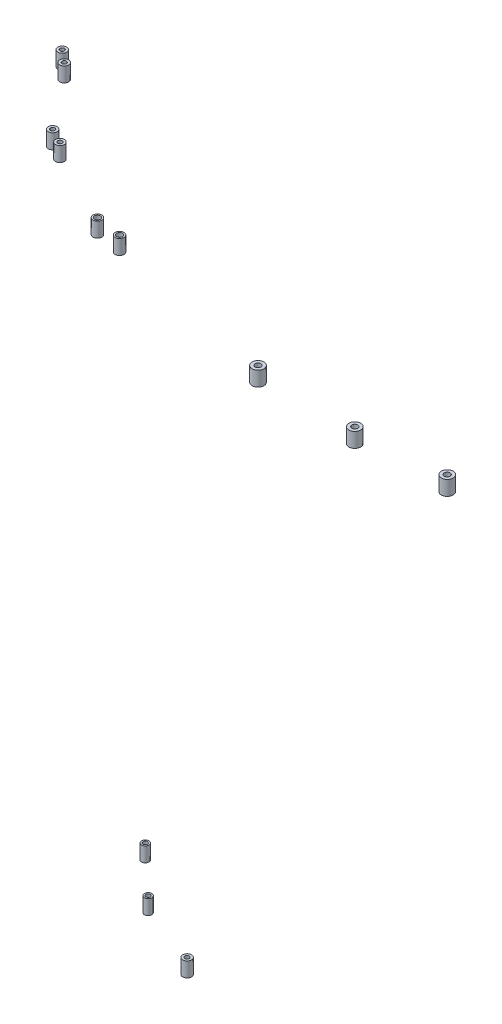
ISO-10303-21;
HEADER;
FILE_DESCRIPTION(('STEP AP214'),'2;1');
FILE_NAME('part.step','',(''),(''),'','','');
FILE_SCHEMA(('AUTOMOTIVE_DESIGN { 1 0 10303 214 1 1 1 1 }'));
ENDSEC;
DATA;
#1=APPLICATION_CONTEXT('core data for automotive mechanical design processes');
#2=APPLICATION_PROTOCOL_DEFINITION('international standard','automotive_design',2000,#1);
#3=PRODUCT_CONTEXT('',#1,'mechanical');
#4=PRODUCT('Part','Part','',(#3));
#5=PRODUCT_RELATED_PRODUCT_CATEGORY('part','',(#4));
#6=PRODUCT_DEFINITION_FORMATION('','',#4);
#7=PRODUCT_DEFINITION_CONTEXT('part definition',#1,'design');
#8=PRODUCT_DEFINITION('design','',#6,#7);
#9=PRODUCT_DEFINITION_SHAPE('','',#8);
#10=(LENGTH_UNIT() NAMED_UNIT(*) SI_UNIT(.MILLI.,.METRE.));
#11=(NAMED_UNIT(*) PLANE_ANGLE_UNIT() SI_UNIT($,.RADIAN.));
#12=(NAMED_UNIT(*) SI_UNIT($,.STERADIAN.) SOLID_ANGLE_UNIT());
#13=UNCERTAINTY_MEASURE_WITH_UNIT(LENGTH_MEASURE(1.E-05),#10,'distance_accuracy_value','');
#14=(GEOMETRIC_REPRESENTATION_CONTEXT(3) GLOBAL_UNCERTAINTY_ASSIGNED_CONTEXT((#13)) GLOBAL_UNIT_ASSIGNED_CONTEXT((#10,
#11,#12)) REPRESENTATION_CONTEXT('',''));
#15=CARTESIAN_POINT('',(0.,0.,0.));
#16=DIRECTION('',(0.,0.,1.));
#17=DIRECTION('',(1.,0.,0.));
#18=AXIS2_PLACEMENT_3D('',#15,#16,#17);
#19=CARTESIAN_POINT('',(-289.687055909534,300.199999999995,-282.424125212581));
#20=DIRECTION('',(0.,1.,1.00971538177767E-12));
#21=DIRECTION('',(0.,1.00971538177767E-12,-1.));
#22=AXIS2_PLACEMENT_3D('',#19,#20,#21);
#23=CYLINDRICAL_SURFACE('',#22,2.99999999999999);
#24=CARTESIAN_POINT('',(-289.687055909534,300.199999999995,-282.424125212581));
#25=DIRECTION('',(0.,-1.,-1.00971538177767E-12));
#26=DIRECTION('',(0.,1.00971538177767E-12,-1.));
#27=AXIS2_PLACEMENT_3D('',#24,#25,#26);
#28=CIRCLE('',#27,2.99999999999999);
#29=CARTESIAN_POINT('',(-289.687055909534,300.199999999998,-285.424125212581));
#30=VERTEX_POINT('',#29);
#31=EDGE_CURVE('E11',#30,#30,#28,.T.);
#32=ORIENTED_EDGE('',*,*,#31,.F.);
#33=EDGE_LOOP('',(#32));
#34=FACE_BOUND('',#33,.T.);
#35=CARTESIAN_POINT('',(-289.687055909534,310.199999999995,-282.424125212571));
#36=DIRECTION('',(0.,-1.,-1.00971538177767E-12));
#37=DIRECTION('',(0.,1.00971538177767E-12,-1.));
#38=AXIS2_PLACEMENT_3D('',#35,#36,#37);
#39=CIRCLE('',#38,2.99999999999999);
#40=CARTESIAN_POINT('',(-289.687055909534,310.199999999998,-285.424125212571));
#41=VERTEX_POINT('',#40);
#42=EDGE_CURVE('E47',#41,#41,#39,.T.);
#43=ORIENTED_EDGE('',*,*,#42,.T.);
#44=EDGE_LOOP('',(#43));
#45=FACE_BOUND('',#44,.T.);
#46=ADVANCED_FACE('F44',(#34,#45),#23,.T.);
#47=CARTESIAN_POINT('',(-289.687055909534,300.199999999995,-282.424125212581));
#48=DIRECTION('',(0.,1.,1.00971538177767E-12));
#49=DIRECTION('',(0.,1.00971538177767E-12,-1.));
#50=AXIS2_PLACEMENT_3D('',#47,#48,#49);
#51=PLANE('',#50);
#52=CARTESIAN_POINT('',(-289.687055909534,300.199999999995,-282.424125212581));
#53=DIRECTION('',(0.,-1.,-1.00971538177767E-12));
#54=DIRECTION('',(0.,1.00971538177767E-12,-1.));
#55=AXIS2_PLACEMENT_3D('',#52,#53,#54);
#56=CIRCLE('',#55,1.50000000000002);
#57=CARTESIAN_POINT('',(-289.687055909534,300.199999999997,-283.924125212581));
#58=VERTEX_POINT('',#57);
#59=EDGE_CURVE('E54',#58,#58,#56,.T.);
#60=ORIENTED_EDGE('',*,*,#59,.F.);
#61=EDGE_LOOP('',(#60));
#62=FACE_BOUND('',#61,.T.);
#63=ORIENTED_EDGE('',*,*,#31,.T.);
#64=EDGE_LOOP('',(#63));
#65=FACE_BOUND('',#64,.T.);
#66=ADVANCED_FACE('F65',(#62,#65),#51,.F.);
#67=CARTESIAN_POINT('',(-289.687055909534,310.199999999995,-282.424125212571));
#68=DIRECTION('',(0.,1.,1.00971538177767E-12));
#69=DIRECTION('',(0.,1.00971538177767E-12,-1.));
#70=AXIS2_PLACEMENT_3D('',#67,#68,#69);
#71=PLANE('',#70);
#72=CARTESIAN_POINT('',(-289.687055909534,310.199999999995,-282.424125212571));
#73=DIRECTION('',(0.,-1.,-1.00971538177767E-12));
#74=DIRECTION('',(0.,1.00971538177767E-12,-1.));
#75=AXIS2_PLACEMENT_3D('',#72,#73,#74);
#76=CIRCLE('',#75,1.50000000000002);
#77=CARTESIAN_POINT('',(-289.687055909534,310.199999999997,-283.924125212571));
#78=VERTEX_POINT('',#77);
#79=EDGE_CURVE('E56',#78,#78,#76,.T.);
#80=ORIENTED_EDGE('',*,*,#79,.T.);
#81=EDGE_LOOP('',(#80));
#82=FACE_BOUND('',#81,.T.);
#83=ORIENTED_EDGE('',*,*,#42,.F.);
#84=EDGE_LOOP('',(#83));
#85=FACE_BOUND('',#84,.T.);
#86=ADVANCED_FACE('F67',(#82,#85),#71,.T.);
#87=CARTESIAN_POINT('',(-289.687055909534,300.199999999995,-282.424125212581));
#88=DIRECTION('',(0.,1.,1.00971538177767E-12));
#89=DIRECTION('',(0.,1.00971538177767E-12,-1.));
#90=AXIS2_PLACEMENT_3D('',#87,#88,#89);
#91=CYLINDRICAL_SURFACE('',#90,1.50000000000002);
#92=ORIENTED_EDGE('',*,*,#59,.T.);
#93=EDGE_LOOP('',(#92));
#94=FACE_BOUND('',#93,.T.);
#95=ORIENTED_EDGE('',*,*,#79,.F.);
#96=EDGE_LOOP('',(#95));
#97=FACE_BOUND('',#96,.T.);
#98=ADVANCED_FACE('F62',(#94,#97),#91,.F.);
#99=CLOSED_SHELL('',(#46,#66,#86,#98));
#100=MANIFOLD_SOLID_BREP('B2',#99);
#101=CARTESIAN_POINT('',(-339.082998520851,300.200000000017,-305.429754445419));
#102=DIRECTION('',(0.,1.,1.00971538177767E-12));
#103=DIRECTION('',(0.,1.00971538177767E-12,-1.));
#104=AXIS2_PLACEMENT_3D('',#101,#102,#103);
#105=CYLINDRICAL_SURFACE('',#104,2.50000000000002);
#106=CARTESIAN_POINT('',(-339.082998520851,300.200000000017,-305.429754445419));
#107=DIRECTION('',(0.,-1.,-1.00971538177767E-12));
#108=DIRECTION('',(0.,1.00971538177767E-12,-1.));
#109=AXIS2_PLACEMENT_3D('',#106,#107,#108);
#110=CIRCLE('',#109,2.50000000000002);
#111=CARTESIAN_POINT('',(-339.082998520851,300.200000000019,-307.929754445419));
#112=VERTEX_POINT('',#111);
#113=EDGE_CURVE('E43',#112,#112,#110,.T.);
#114=ORIENTED_EDGE('',*,*,#113,.F.);
#115=EDGE_LOOP('',(#114));
#116=FACE_BOUND('',#115,.T.);
#117=CARTESIAN_POINT('',(-339.082998520851,310.200000000017,-305.429754445409));
#118=DIRECTION('',(0.,-1.,-1.00971538177767E-12));
#119=DIRECTION('',(0.,1.00971538177767E-12,-1.));
#120=AXIS2_PLACEMENT_3D('',#117,#118,#119);
#121=CIRCLE('',#120,2.50000000000002);
#122=CARTESIAN_POINT('',(-339.082998520851,310.200000000019,-307.929754445409));
#123=VERTEX_POINT('',#122);
#124=EDGE_CURVE('E117',#123,#123,#121,.T.);
#125=ORIENTED_EDGE('',*,*,#124,.T.);
#126=EDGE_LOOP('',(#125));
#127=FACE_BOUND('',#126,.T.);
#128=ADVANCED_FACE('F114',(#116,#127),#105,.T.);
#129=CARTESIAN_POINT('',(-339.082998520851,300.200000000017,-305.429754445419));
#130=DIRECTION('',(0.,1.,1.00971538177767E-12));
#131=DIRECTION('',(0.,1.00971538177767E-12,-1.));
#132=AXIS2_PLACEMENT_3D('',#129,#130,#131);
#133=PLANE('',#132);
#134=CARTESIAN_POINT('',(-339.082998520851,300.200000000017,-305.429754445419));
#135=DIRECTION('',(0.,-1.,-1.00971538177767E-12));
#136=DIRECTION('',(0.,1.00971538177767E-12,-1.));
#137=AXIS2_PLACEMENT_3D('',#134,#135,#136);
#138=CIRCLE('',#137,1.50000000000002);
#139=CARTESIAN_POINT('',(-339.082998520851,300.200000000018,-306.929754445419));
#140=VERTEX_POINT('',#139);
#141=EDGE_CURVE('E124',#140,#140,#138,.T.);
#142=ORIENTED_EDGE('',*,*,#141,.F.);
#143=EDGE_LOOP('',(#142));
#144=FACE_BOUND('',#143,.T.);
#145=ORIENTED_EDGE('',*,*,#113,.T.);
#146=EDGE_LOOP('',(#145));
#147=FACE_BOUND('',#146,.T.);
#148=ADVANCED_FACE('F135',(#144,#147),#133,.F.);
#149=CARTESIAN_POINT('',(-339.082998520851,310.200000000017,-305.429754445409));
#150=DIRECTION('',(0.,1.,1.00971538177767E-12));
#151=DIRECTION('',(0.,1.00971538177767E-12,-1.));
#152=AXIS2_PLACEMENT_3D('',#149,#150,#151);
#153=PLANE('',#152);
#154=CARTESIAN_POINT('',(-339.082998520851,310.200000000017,-305.429754445409));
#155=DIRECTION('',(0.,-1.,-1.00971538177767E-12));
#156=DIRECTION('',(0.,1.00971538177767E-12,-1.));
#157=AXIS2_PLACEMENT_3D('',#154,#155,#156);
#158=CIRCLE('',#157,1.50000000000002);
#159=CARTESIAN_POINT('',(-339.082998520851,310.200000000018,-306.929754445409));
#160=VERTEX_POINT('',#159);
#161=EDGE_CURVE('E126',#160,#160,#158,.T.);
#162=ORIENTED_EDGE('',*,*,#161,.T.);
#163=EDGE_LOOP('',(#162));
#164=FACE_BOUND('',#163,.T.);
#165=ORIENTED_EDGE('',*,*,#124,.F.);
#166=EDGE_LOOP('',(#165));
#167=FACE_BOUND('',#166,.T.);
#168=ADVANCED_FACE('F137',(#164,#167),#153,.T.);
#169=CARTESIAN_POINT('',(-339.082998520851,300.200000000017,-305.429754445419));
#170=DIRECTION('',(0.,1.,1.00971538177767E-12));
#171=DIRECTION('',(0.,1.00971538177767E-12,-1.));
#172=AXIS2_PLACEMENT_3D('',#169,#170,#171);
#173=CYLINDRICAL_SURFACE('',#172,1.50000000000002);
#174=ORIENTED_EDGE('',*,*,#141,.T.);
#175=EDGE_LOOP('',(#174));
#176=FACE_BOUND('',#175,.T.);
#177=ORIENTED_EDGE('',*,*,#161,.F.);
#178=EDGE_LOOP('',(#177));
#179=FACE_BOUND('',#178,.T.);
#180=ADVANCED_FACE('F132',(#176,#179),#173,.F.);
#181=CLOSED_SHELL('',(#128,#148,#168,#180));
#182=MANIFOLD_SOLID_BREP('B6',#181);
#183=CARTESIAN_POINT('',(-370.956911026411,300.200000000046,-335.367132453129));
#184=DIRECTION('',(0.,1.,1.00971538177767E-12));
#185=DIRECTION('',(0.,1.00971538177767E-12,-1.));
#186=AXIS2_PLACEMENT_3D('',#183,#184,#185);
#187=CYLINDRICAL_SURFACE('',#186,2.50000000000002);
#188=CARTESIAN_POINT('',(-370.956911026411,300.200000000046,-335.367132453129));
#189=DIRECTION('',(0.,-1.,-1.00971538177767E-12));
#190=DIRECTION('',(0.,1.00971538177767E-12,-1.));
#191=AXIS2_PLACEMENT_3D('',#188,#189,#190);
#192=CIRCLE('',#191,2.50000000000002);
#193=CARTESIAN_POINT('',(-370.956911026411,300.200000000049,-337.867132453129));
#194=VERTEX_POINT('',#193);
#195=EDGE_CURVE('E113',#194,#194,#192,.T.);
#196=ORIENTED_EDGE('',*,*,#195,.F.);
#197=EDGE_LOOP('',(#196));
#198=FACE_BOUND('',#197,.T.);
#199=CARTESIAN_POINT('',(-370.956911026411,310.200000000046,-335.367132453118));
#200=DIRECTION('',(0.,-1.,-1.00971538177767E-12));
#201=DIRECTION('',(0.,1.00971538177767E-12,-1.));
#202=AXIS2_PLACEMENT_3D('',#199,#200,#201);
#203=CIRCLE('',#202,2.50000000000002);
#204=CARTESIAN_POINT('',(-370.956911026411,310.200000000049,-337.867132453118));
#205=VERTEX_POINT('',#204);
#206=EDGE_CURVE('E187',#205,#205,#203,.T.);
#207=ORIENTED_EDGE('',*,*,#206,.T.);
#208=EDGE_LOOP('',(#207));
#209=FACE_BOUND('',#208,.T.);
#210=ADVANCED_FACE('F184',(#198,#209),#187,.T.);
#211=CARTESIAN_POINT('',(-370.956911026411,300.200000000046,-335.367132453129));
#212=DIRECTION('',(0.,1.,1.00971538177767E-12));
#213=DIRECTION('',(0.,1.00971538177767E-12,-1.));
#214=AXIS2_PLACEMENT_3D('',#211,#212,#213);
#215=PLANE('',#214);
#216=CARTESIAN_POINT('',(-370.956911026411,300.200000000046,-335.367132453129));
#217=DIRECTION('',(0.,-1.,-1.00971538177767E-12));
#218=DIRECTION('',(0.,1.00971538177767E-12,-1.));
#219=AXIS2_PLACEMENT_3D('',#216,#217,#218);
#220=CIRCLE('',#219,1.50000000000002);
#221=CARTESIAN_POINT('',(-370.956911026411,300.200000000048,-336.867132453129));
#222=VERTEX_POINT('',#221);
#223=EDGE_CURVE('E194',#222,#222,#220,.T.);
#224=ORIENTED_EDGE('',*,*,#223,.F.);
#225=EDGE_LOOP('',(#224));
#226=FACE_BOUND('',#225,.T.);
#227=ORIENTED_EDGE('',*,*,#195,.T.);
#228=EDGE_LOOP('',(#227));
#229=FACE_BOUND('',#228,.T.);
#230=ADVANCED_FACE('F205',(#226,#229),#215,.F.);
#231=CARTESIAN_POINT('',(-370.956911026411,310.200000000046,-335.367132453118));
#232=DIRECTION('',(0.,1.,1.00971538177767E-12));
#233=DIRECTION('',(0.,1.00971538177767E-12,-1.));
#234=AXIS2_PLACEMENT_3D('',#231,#232,#233);
#235=PLANE('',#234);
#236=CARTESIAN_POINT('',(-370.956911026411,310.200000000046,-335.367132453118));
#237=DIRECTION('',(0.,-1.,-1.00971538177767E-12));
#238=DIRECTION('',(0.,1.00971538177767E-12,-1.));
#239=AXIS2_PLACEMENT_3D('',#236,#237,#238);
#240=CIRCLE('',#239,1.50000000000002);
#241=CARTESIAN_POINT('',(-370.956911026411,310.200000000048,-336.867132453118));
#242=VERTEX_POINT('',#241);
#243=EDGE_CURVE('E196',#242,#242,#240,.T.);
#244=ORIENTED_EDGE('',*,*,#243,.T.);
#245=EDGE_LOOP('',(#244));
#246=FACE_BOUND('',#245,.T.);
#247=ORIENTED_EDGE('',*,*,#206,.F.);
#248=EDGE_LOOP('',(#247));
#249=FACE_BOUND('',#248,.T.);
#250=ADVANCED_FACE('F207',(#246,#249),#235,.T.);
#251=CARTESIAN_POINT('',(-370.956911026411,300.200000000046,-335.367132453129));
#252=DIRECTION('',(0.,1.,1.00971538177767E-12));
#253=DIRECTION('',(0.,1.00971538177767E-12,-1.));
#254=AXIS2_PLACEMENT_3D('',#251,#252,#253);
#255=CYLINDRICAL_SURFACE('',#254,1.50000000000002);
#256=ORIENTED_EDGE('',*,*,#223,.T.);
#257=EDGE_LOOP('',(#256));
#258=FACE_BOUND('',#257,.T.);
#259=ORIENTED_EDGE('',*,*,#243,.F.);
#260=EDGE_LOOP('',(#259));
#261=FACE_BOUND('',#260,.T.);
#262=ADVANCED_FACE('F202',(#258,#261),#255,.F.);
#263=CLOSED_SHELL('',(#210,#230,#250,#262));
#264=MANIFOLD_SOLID_BREP('B38',#263);
#265=CARTESIAN_POINT('',(-94.9095215443751,690.,-263.802212935845));
#266=DIRECTION('',(0.,1.,0.));
#267=DIRECTION('',(0.,0.,-1.));
#268=AXIS2_PLACEMENT_3D('',#265,#266,#267);
#269=CYLINDRICAL_SURFACE('',#268,4.00000000000001);
#270=CARTESIAN_POINT('',(-94.9095215443751,690.,-263.802212935845));
#271=DIRECTION('',(0.,-1.,0.));
#272=DIRECTION('',(0.,0.,-1.));
#273=AXIS2_PLACEMENT_3D('',#270,#271,#272);
#274=CIRCLE('',#273,4.00000000000001);
#275=CARTESIAN_POINT('',(-94.9095215443751,690.,-267.802212935845));
#276=VERTEX_POINT('',#275);
#277=EDGE_CURVE('E183',#276,#276,#274,.T.);
#278=ORIENTED_EDGE('',*,*,#277,.F.);
#279=EDGE_LOOP('',(#278));
#280=FACE_BOUND('',#279,.T.);
#281=CARTESIAN_POINT('',(-94.9095215443751,700.,-263.802212935845));
#282=DIRECTION('',(0.,-1.,0.));
#283=DIRECTION('',(0.,0.,-1.));
#284=AXIS2_PLACEMENT_3D('',#281,#282,#283);
#285=CIRCLE('',#284,4.00000000000001);
#286=CARTESIAN_POINT('',(-94.9095215443751,700.,-267.802212935845));
#287=VERTEX_POINT('',#286);
#288=EDGE_CURVE('E257',#287,#287,#285,.T.);
#289=ORIENTED_EDGE('',*,*,#288,.T.);
#290=EDGE_LOOP('',(#289));
#291=FACE_BOUND('',#290,.T.);
#292=ADVANCED_FACE('F254',(#280,#291),#269,.T.);
#293=CARTESIAN_POINT('',(-94.9095215443751,690.,-263.802212935845));
#294=DIRECTION('',(0.,1.,0.));
#295=DIRECTION('',(0.,0.,-1.));
#296=AXIS2_PLACEMENT_3D('',#293,#294,#295);
#297=PLANE('',#296);
#298=CARTESIAN_POINT('',(-94.9095215443751,690.,-263.802212935845));
#299=DIRECTION('',(0.,-1.,0.));
#300=DIRECTION('',(0.,0.,-1.));
#301=AXIS2_PLACEMENT_3D('',#298,#299,#300);
#302=CIRCLE('',#301,2.);
#303=CARTESIAN_POINT('',(-94.9095215443751,690.,-265.802212935845));
#304=VERTEX_POINT('',#303);
#305=EDGE_CURVE('E264',#304,#304,#302,.T.);
#306=ORIENTED_EDGE('',*,*,#305,.F.);
#307=EDGE_LOOP('',(#306));
#308=FACE_BOUND('',#307,.T.);
#309=ORIENTED_EDGE('',*,*,#277,.T.);
#310=EDGE_LOOP('',(#309));
#311=FACE_BOUND('',#310,.T.);
#312=ADVANCED_FACE('F275',(#308,#311),#297,.F.);
#313=CARTESIAN_POINT('',(-94.9095215443751,700.,-263.802212935845));
#314=DIRECTION('',(0.,1.,0.));
#315=DIRECTION('',(0.,0.,-1.));
#316=AXIS2_PLACEMENT_3D('',#313,#314,#315);
#317=PLANE('',#316);
#318=CARTESIAN_POINT('',(-94.9095215443751,700.,-263.802212935845));
#319=DIRECTION('',(0.,-1.,0.));
#320=DIRECTION('',(0.,0.,-1.));
#321=AXIS2_PLACEMENT_3D('',#318,#319,#320);
#322=CIRCLE('',#321,2.);
#323=CARTESIAN_POINT('',(-94.9095215443751,700.,-265.802212935845));
#324=VERTEX_POINT('',#323);
#325=EDGE_CURVE('E266',#324,#324,#322,.T.);
#326=ORIENTED_EDGE('',*,*,#325,.T.);
#327=EDGE_LOOP('',(#326));
#328=FACE_BOUND('',#327,.T.);
#329=ORIENTED_EDGE('',*,*,#288,.F.);
#330=EDGE_LOOP('',(#329));
#331=FACE_BOUND('',#330,.T.);
#332=ADVANCED_FACE('F277',(#328,#331),#317,.T.);
#333=CARTESIAN_POINT('',(-94.9095215443751,690.,-263.802212935845));
#334=DIRECTION('',(0.,1.,0.));
#335=DIRECTION('',(0.,0.,-1.));
#336=AXIS2_PLACEMENT_3D('',#333,#334,#335);
#337=CYLINDRICAL_SURFACE('',#336,2.);
#338=ORIENTED_EDGE('',*,*,#305,.T.);
#339=EDGE_LOOP('',(#338));
#340=FACE_BOUND('',#339,.T.);
#341=ORIENTED_EDGE('',*,*,#325,.F.);
#342=EDGE_LOOP('',(#341));
#343=FACE_BOUND('',#342,.T.);
#344=ADVANCED_FACE('F272',(#340,#343),#337,.F.);
#345=CLOSED_SHELL('',(#292,#312,#332,#344));
#346=MANIFOLD_SOLID_BREP('B108',#345);
#347=CARTESIAN_POINT('',(-154.344703344319,690.,-260.643821632466));
#348=DIRECTION('',(0.,1.,0.));
#349=DIRECTION('',(0.,0.,-1.));
#350=AXIS2_PLACEMENT_3D('',#347,#348,#349);
#351=CYLINDRICAL_SURFACE('',#350,3.99999999999999);
#352=CARTESIAN_POINT('',(-154.344703344319,690.,-260.643821632466));
#353=DIRECTION('',(0.,-1.,0.));
#354=DIRECTION('',(0.,0.,-1.));
#355=AXIS2_PLACEMENT_3D('',#352,#353,#354);
#356=CIRCLE('',#355,3.99999999999999);
#357=CARTESIAN_POINT('',(-154.344703344319,690.,-264.643821632466));
#358=VERTEX_POINT('',#357);
#359=EDGE_CURVE('E253',#358,#358,#356,.T.);
#360=ORIENTED_EDGE('',*,*,#359,.F.);
#361=EDGE_LOOP('',(#360));
#362=FACE_BOUND('',#361,.T.);
#363=CARTESIAN_POINT('',(-154.344703344319,700.,-260.643821632466));
#364=DIRECTION('',(0.,-1.,0.));
#365=DIRECTION('',(0.,0.,-1.));
#366=AXIS2_PLACEMENT_3D('',#363,#364,#365);
#367=CIRCLE('',#366,3.99999999999999);
#368=CARTESIAN_POINT('',(-154.344703344319,700.,-264.643821632466));
#369=VERTEX_POINT('',#368);
#370=EDGE_CURVE('E327',#369,#369,#367,.T.);
#371=ORIENTED_EDGE('',*,*,#370,.T.);
#372=EDGE_LOOP('',(#371));
#373=FACE_BOUND('',#372,.T.);
#374=ADVANCED_FACE('F324',(#362,#373),#351,.T.);
#375=CARTESIAN_POINT('',(-154.344703344319,690.,-260.643821632466));
#376=DIRECTION('',(0.,1.,0.));
#377=DIRECTION('',(0.,0.,-1.));
#378=AXIS2_PLACEMENT_3D('',#375,#376,#377);
#379=PLANE('',#378);
#380=CARTESIAN_POINT('',(-154.344703344319,690.,-260.643821632466));
#381=DIRECTION('',(0.,-1.,0.));
#382=DIRECTION('',(0.,0.,-1.));
#383=AXIS2_PLACEMENT_3D('',#380,#381,#382);
#384=CIRCLE('',#383,2.);
#385=CARTESIAN_POINT('',(-154.344703344319,690.,-262.643821632466));
#386=VERTEX_POINT('',#385);
#387=EDGE_CURVE('E334',#386,#386,#384,.T.);
#388=ORIENTED_EDGE('',*,*,#387,.F.);
#389=EDGE_LOOP('',(#388));
#390=FACE_BOUND('',#389,.T.);
#391=ORIENTED_EDGE('',*,*,#359,.T.);
#392=EDGE_LOOP('',(#391));
#393=FACE_BOUND('',#392,.T.);
#394=ADVANCED_FACE('F345',(#390,#393),#379,.F.);
#395=CARTESIAN_POINT('',(-154.344703344319,700.,-260.643821632466));
#396=DIRECTION('',(0.,1.,0.));
#397=DIRECTION('',(0.,0.,-1.));
#398=AXIS2_PLACEMENT_3D('',#395,#396,#397);
#399=PLANE('',#398);
#400=CARTESIAN_POINT('',(-154.344703344319,700.,-260.643821632466));
#401=DIRECTION('',(0.,-1.,0.));
#402=DIRECTION('',(0.,0.,-1.));
#403=AXIS2_PLACEMENT_3D('',#400,#401,#402);
#404=CIRCLE('',#403,2.);
#405=CARTESIAN_POINT('',(-154.344703344319,700.,-262.643821632466));
#406=VERTEX_POINT('',#405);
#407=EDGE_CURVE('E336',#406,#406,#404,.T.);
#408=ORIENTED_EDGE('',*,*,#407,.T.);
#409=EDGE_LOOP('',(#408));
#410=FACE_BOUND('',#409,.T.);
#411=ORIENTED_EDGE('',*,*,#370,.F.);
#412=EDGE_LOOP('',(#411));
#413=FACE_BOUND('',#412,.T.);
#414=ADVANCED_FACE('F347',(#410,#413),#399,.T.);
#415=CARTESIAN_POINT('',(-154.344703344319,690.,-260.643821632466));
#416=DIRECTION('',(0.,1.,0.));
#417=DIRECTION('',(0.,0.,-1.));
#418=AXIS2_PLACEMENT_3D('',#415,#416,#417);
#419=CYLINDRICAL_SURFACE('',#418,2.);
#420=ORIENTED_EDGE('',*,*,#387,.T.);
#421=EDGE_LOOP('',(#420));
#422=FACE_BOUND('',#421,.T.);
#423=ORIENTED_EDGE('',*,*,#407,.F.);
#424=EDGE_LOOP('',(#423));
#425=FACE_BOUND('',#424,.T.);
#426=ADVANCED_FACE('F342',(#422,#425),#419,.F.);
#427=CLOSED_SHELL('',(#374,#394,#414,#426));
#428=MANIFOLD_SOLID_BREP('B178',#427);
#429=CARTESIAN_POINT('',(-223.024834580686,690.,-263.802212935845));
#430=DIRECTION('',(0.,1.,0.));
#431=DIRECTION('',(0.,0.,-1.));
#432=AXIS2_PLACEMENT_3D('',#429,#430,#431);
#433=CYLINDRICAL_SURFACE('',#432,3.99999999999999);
#434=CARTESIAN_POINT('',(-223.024834580686,690.,-263.802212935845));
#435=DIRECTION('',(0.,-1.,0.));
#436=DIRECTION('',(0.,0.,-1.));
#437=AXIS2_PLACEMENT_3D('',#434,#435,#436);
#438=CIRCLE('',#437,3.99999999999999);
#439=CARTESIAN_POINT('',(-223.024834580686,690.,-267.802212935845));
#440=VERTEX_POINT('',#439);
#441=EDGE_CURVE('E323',#440,#440,#438,.T.);
#442=ORIENTED_EDGE('',*,*,#441,.F.);
#443=EDGE_LOOP('',(#442));
#444=FACE_BOUND('',#443,.T.);
#445=CARTESIAN_POINT('',(-223.024834580686,700.,-263.802212935845));
#446=DIRECTION('',(0.,-1.,0.));
#447=DIRECTION('',(0.,0.,-1.));
#448=AXIS2_PLACEMENT_3D('',#445,#446,#447);
#449=CIRCLE('',#448,3.99999999999999);
#450=CARTESIAN_POINT('',(-223.024834580686,700.,-267.802212935845));
#451=VERTEX_POINT('',#450);
#452=EDGE_CURVE('E397',#451,#451,#449,.T.);
#453=ORIENTED_EDGE('',*,*,#452,.T.);
#454=EDGE_LOOP('',(#453));
#455=FACE_BOUND('',#454,.T.);
#456=ADVANCED_FACE('F394',(#444,#455),#433,.T.);
#457=CARTESIAN_POINT('',(-223.024834580686,690.,-263.802212935845));
#458=DIRECTION('',(0.,1.,0.));
#459=DIRECTION('',(0.,0.,-1.));
#460=AXIS2_PLACEMENT_3D('',#457,#458,#459);
#461=PLANE('',#460);
#462=CARTESIAN_POINT('',(-223.024834580686,690.,-263.802212935845));
#463=DIRECTION('',(0.,-1.,0.));
#464=DIRECTION('',(0.,0.,-1.));
#465=AXIS2_PLACEMENT_3D('',#462,#463,#464);
#466=CIRCLE('',#465,2.);
#467=CARTESIAN_POINT('',(-223.024834580686,690.,-265.802212935845));
#468=VERTEX_POINT('',#467);
#469=EDGE_CURVE('E404',#468,#468,#466,.T.);
#470=ORIENTED_EDGE('',*,*,#469,.F.);
#471=EDGE_LOOP('',(#470));
#472=FACE_BOUND('',#471,.T.);
#473=ORIENTED_EDGE('',*,*,#441,.T.);
#474=EDGE_LOOP('',(#473));
#475=FACE_BOUND('',#474,.T.);
#476=ADVANCED_FACE('F415',(#472,#475),#461,.F.);
#477=CARTESIAN_POINT('',(-223.024834580686,700.,-263.802212935845));
#478=DIRECTION('',(0.,1.,0.));
#479=DIRECTION('',(0.,0.,-1.));
#480=AXIS2_PLACEMENT_3D('',#477,#478,#479);
#481=PLANE('',#480);
#482=CARTESIAN_POINT('',(-223.024834580686,700.,-263.802212935845));
#483=DIRECTION('',(0.,-1.,0.));
#484=DIRECTION('',(0.,0.,-1.));
#485=AXIS2_PLACEMENT_3D('',#482,#483,#484);
#486=CIRCLE('',#485,2.);
#487=CARTESIAN_POINT('',(-223.024834580686,700.,-265.802212935845));
#488=VERTEX_POINT('',#487);
#489=EDGE_CURVE('E406',#488,#488,#486,.T.);
#490=ORIENTED_EDGE('',*,*,#489,.T.);
#491=EDGE_LOOP('',(#490));
#492=FACE_BOUND('',#491,.T.);
#493=ORIENTED_EDGE('',*,*,#452,.F.);
#494=EDGE_LOOP('',(#493));
#495=FACE_BOUND('',#494,.T.);
#496=ADVANCED_FACE('F417',(#492,#495),#481,.T.);
#497=CARTESIAN_POINT('',(-223.024834580686,690.,-263.802212935845));
#498=DIRECTION('',(0.,1.,0.));
#499=DIRECTION('',(0.,0.,-1.));
#500=AXIS2_PLACEMENT_3D('',#497,#498,#499);
#501=CYLINDRICAL_SURFACE('',#500,2.);
#502=ORIENTED_EDGE('',*,*,#469,.T.);
#503=EDGE_LOOP('',(#502));
#504=FACE_BOUND('',#503,.T.);
#505=ORIENTED_EDGE('',*,*,#489,.F.);
#506=EDGE_LOOP('',(#505));
#507=FACE_BOUND('',#506,.T.);
#508=ADVANCED_FACE('F412',(#504,#507),#501,.F.);
#509=CLOSED_SHELL('',(#456,#476,#496,#508));
#510=MANIFOLD_SOLID_BREP('B248',#509);
#511=CARTESIAN_POINT('',(-346.389872513205,690.,-293.396246383283));
#512=DIRECTION('',(0.,1.,0.));
#513=DIRECTION('',(0.,0.,-1.));
#514=AXIS2_PLACEMENT_3D('',#511,#512,#513);
#515=CYLINDRICAL_SURFACE('',#514,2.99999999999999);
#516=CARTESIAN_POINT('',(-346.389872513205,690.,-293.396246383283));
#517=DIRECTION('',(0.,-1.,0.));
#518=DIRECTION('',(0.,0.,-1.));
#519=AXIS2_PLACEMENT_3D('',#516,#517,#518);
#520=CIRCLE('',#519,2.99999999999999);
#521=CARTESIAN_POINT('',(-346.389872513205,690.,-296.396246383283));
#522=VERTEX_POINT('',#521);
#523=EDGE_CURVE('E393',#522,#522,#520,.T.);
#524=ORIENTED_EDGE('',*,*,#523,.F.);
#525=EDGE_LOOP('',(#524));
#526=FACE_BOUND('',#525,.T.);
#527=CARTESIAN_POINT('',(-346.389872513205,700.,-293.396246383283));
#528=DIRECTION('',(0.,-1.,0.));
#529=DIRECTION('',(0.,0.,-1.));
#530=AXIS2_PLACEMENT_3D('',#527,#528,#529);
#531=CIRCLE('',#530,2.99999999999999);
#532=CARTESIAN_POINT('',(-346.389872513205,700.,-296.396246383283));
#533=VERTEX_POINT('',#532);
#534=EDGE_CURVE('E467',#533,#533,#531,.T.);
#535=ORIENTED_EDGE('',*,*,#534,.T.);
#536=EDGE_LOOP('',(#535));
#537=FACE_BOUND('',#536,.T.);
#538=ADVANCED_FACE('F464',(#526,#537),#515,.T.);
#539=CARTESIAN_POINT('',(-346.389872513205,690.,-293.396246383283));
#540=DIRECTION('',(0.,1.,0.));
#541=DIRECTION('',(0.,0.,-1.));
#542=AXIS2_PLACEMENT_3D('',#539,#540,#541);
#543=PLANE('',#542);
#544=CARTESIAN_POINT('',(-346.389872513205,690.,-293.396246383283));
#545=DIRECTION('',(0.,-1.,0.));
#546=DIRECTION('',(0.,0.,-1.));
#547=AXIS2_PLACEMENT_3D('',#544,#545,#546);
#548=CIRCLE('',#547,2.);
#549=CARTESIAN_POINT('',(-346.389872513205,690.,-295.396246383283));
#550=VERTEX_POINT('',#549);
#551=EDGE_CURVE('E474',#550,#550,#548,.T.);
#552=ORIENTED_EDGE('',*,*,#551,.F.);
#553=EDGE_LOOP('',(#552));
#554=FACE_BOUND('',#553,.T.);
#555=ORIENTED_EDGE('',*,*,#523,.T.);
#556=EDGE_LOOP('',(#555));
#557=FACE_BOUND('',#556,.T.);
#558=ADVANCED_FACE('F485',(#554,#557),#543,.F.);
#559=CARTESIAN_POINT('',(-346.389872513205,700.,-293.396246383283));
#560=DIRECTION('',(0.,1.,0.));
#561=DIRECTION('',(0.,0.,-1.));
#562=AXIS2_PLACEMENT_3D('',#559,#560,#561);
#563=PLANE('',#562);
#564=CARTESIAN_POINT('',(-346.389872513205,700.,-293.396246383283));
#565=DIRECTION('',(0.,-1.,0.));
#566=DIRECTION('',(0.,0.,-1.));
#567=AXIS2_PLACEMENT_3D('',#564,#565,#566);
#568=CIRCLE('',#567,2.);
#569=CARTESIAN_POINT('',(-346.389872513205,700.,-295.396246383283));
#570=VERTEX_POINT('',#569);
#571=EDGE_CURVE('E476',#570,#570,#568,.T.);
#572=ORIENTED_EDGE('',*,*,#571,.T.);
#573=EDGE_LOOP('',(#572));
#574=FACE_BOUND('',#573,.T.);
#575=ORIENTED_EDGE('',*,*,#534,.F.);
#576=EDGE_LOOP('',(#575));
#577=FACE_BOUND('',#576,.T.);
#578=ADVANCED_FACE('F487',(#574,#577),#563,.T.);
#579=CARTESIAN_POINT('',(-346.389872513205,690.,-293.396246383283));
#580=DIRECTION('',(0.,1.,0.));
#581=DIRECTION('',(0.,0.,-1.));
#582=AXIS2_PLACEMENT_3D('',#579,#580,#581);
#583=CYLINDRICAL_SURFACE('',#582,2.);
#584=ORIENTED_EDGE('',*,*,#551,.T.);
#585=EDGE_LOOP('',(#584));
#586=FACE_BOUND('',#585,.T.);
#587=ORIENTED_EDGE('',*,*,#571,.F.);
#588=EDGE_LOOP('',(#587));
#589=FACE_BOUND('',#588,.T.);
#590=ADVANCED_FACE('F482',(#586,#589),#583,.F.);
#591=CLOSED_SHELL('',(#538,#558,#578,#590));
#592=MANIFOLD_SOLID_BREP('B318',#591);
#593=CARTESIAN_POINT('',(-364.051137420954,690.,-296.101801858513));
#594=DIRECTION('',(0.,1.,0.));
#595=DIRECTION('',(0.,0.,-1.));
#596=AXIS2_PLACEMENT_3D('',#593,#594,#595);
#597=CYLINDRICAL_SURFACE('',#596,2.99999999999999);
#598=CARTESIAN_POINT('',(-364.051137420954,690.,-296.101801858513));
#599=DIRECTION('',(0.,-1.,0.));
#600=DIRECTION('',(0.,0.,-1.));
#601=AXIS2_PLACEMENT_3D('',#598,#599,#600);
#602=CIRCLE('',#601,2.99999999999999);
#603=CARTESIAN_POINT('',(-364.051137420954,690.,-299.101801858513));
#604=VERTEX_POINT('',#603);
#605=EDGE_CURVE('E463',#604,#604,#602,.T.);
#606=ORIENTED_EDGE('',*,*,#605,.F.);
#607=EDGE_LOOP('',(#606));
#608=FACE_BOUND('',#607,.T.);
#609=CARTESIAN_POINT('',(-364.051137420954,700.,-296.101801858513));
#610=DIRECTION('',(0.,-1.,0.));
#611=DIRECTION('',(0.,0.,-1.));
#612=AXIS2_PLACEMENT_3D('',#609,#610,#611);
#613=CIRCLE('',#612,2.99999999999999);
#614=CARTESIAN_POINT('',(-364.051137420954,700.,-299.101801858513));
#615=VERTEX_POINT('',#614);
#616=EDGE_CURVE('E537',#615,#615,#613,.T.);
#617=ORIENTED_EDGE('',*,*,#616,.T.);
#618=EDGE_LOOP('',(#617));
#619=FACE_BOUND('',#618,.T.);
#620=ADVANCED_FACE('F534',(#608,#619),#597,.T.);
#621=CARTESIAN_POINT('',(-364.051137420954,690.,-296.101801858513));
#622=DIRECTION('',(0.,1.,0.));
#623=DIRECTION('',(0.,0.,-1.));
#624=AXIS2_PLACEMENT_3D('',#621,#622,#623);
#625=PLANE('',#624);
#626=CARTESIAN_POINT('',(-364.051137420954,690.,-296.101801858513));
#627=DIRECTION('',(0.,-1.,0.));
#628=DIRECTION('',(0.,0.,-1.));
#629=AXIS2_PLACEMENT_3D('',#626,#627,#628);
#630=CIRCLE('',#629,2.);
#631=CARTESIAN_POINT('',(-364.051137420954,690.,-298.101801858513));
#632=VERTEX_POINT('',#631);
#633=EDGE_CURVE('E544',#632,#632,#630,.T.);
#634=ORIENTED_EDGE('',*,*,#633,.F.);
#635=EDGE_LOOP('',(#634));
#636=FACE_BOUND('',#635,.T.);
#637=ORIENTED_EDGE('',*,*,#605,.T.);
#638=EDGE_LOOP('',(#637));
#639=FACE_BOUND('',#638,.T.);
#640=ADVANCED_FACE('F555',(#636,#639),#625,.F.);
#641=CARTESIAN_POINT('',(-364.051137420954,700.,-296.101801858513));
#642=DIRECTION('',(0.,1.,0.));
#643=DIRECTION('',(0.,0.,-1.));
#644=AXIS2_PLACEMENT_3D('',#641,#642,#643);
#645=PLANE('',#644);
#646=CARTESIAN_POINT('',(-364.051137420954,700.,-296.101801858513));
#647=DIRECTION('',(0.,-1.,0.));
#648=DIRECTION('',(0.,0.,-1.));
#649=AXIS2_PLACEMENT_3D('',#646,#647,#648);
#650=CIRCLE('',#649,2.);
#651=CARTESIAN_POINT('',(-364.051137420954,700.,-298.101801858513));
#652=VERTEX_POINT('',#651);
#653=EDGE_CURVE('E546',#652,#652,#650,.T.);
#654=ORIENTED_EDGE('',*,*,#653,.T.);
#655=EDGE_LOOP('',(#654));
#656=FACE_BOUND('',#655,.T.);
#657=ORIENTED_EDGE('',*,*,#616,.F.);
#658=EDGE_LOOP('',(#657));
#659=FACE_BOUND('',#658,.T.);
#660=ADVANCED_FACE('F557',(#656,#659),#645,.T.);
#661=CARTESIAN_POINT('',(-364.051137420954,690.,-296.101801858513));
#662=DIRECTION('',(0.,1.,0.));
#663=DIRECTION('',(0.,0.,-1.));
#664=AXIS2_PLACEMENT_3D('',#661,#662,#663);
#665=CYLINDRICAL_SURFACE('',#664,2.);
#666=ORIENTED_EDGE('',*,*,#633,.T.);
#667=EDGE_LOOP('',(#666));
#668=FACE_BOUND('',#667,.T.);
#669=ORIENTED_EDGE('',*,*,#653,.F.);
#670=EDGE_LOOP('',(#669));
#671=FACE_BOUND('',#670,.T.);
#672=ADVANCED_FACE('F552',(#668,#671),#665,.F.);
#673=CLOSED_SHELL('',(#620,#640,#660,#672));
#674=MANIFOLD_SOLID_BREP('B388',#673);
#675=CARTESIAN_POINT('',(-421.090050281492,690.,-327.725114351705));
#676=DIRECTION('',(0.,1.,0.));
#677=DIRECTION('',(0.,0.,-1.));
#678=AXIS2_PLACEMENT_3D('',#675,#676,#677);
#679=CYLINDRICAL_SURFACE('',#678,2.99999999999999);
#680=CARTESIAN_POINT('',(-421.090050281492,690.,-327.725114351705));
#681=DIRECTION('',(0.,-1.,0.));
#682=DIRECTION('',(0.,0.,-1.));
#683=AXIS2_PLACEMENT_3D('',#680,#681,#682);
#684=CIRCLE('',#683,2.99999999999999);
#685=CARTESIAN_POINT('',(-421.090050281492,690.,-330.725114351705));
#686=VERTEX_POINT('',#685);
#687=EDGE_CURVE('E533',#686,#686,#684,.T.);
#688=ORIENTED_EDGE('',*,*,#687,.F.);
#689=EDGE_LOOP('',(#688));
#690=FACE_BOUND('',#689,.T.);
#691=CARTESIAN_POINT('',(-421.090050281492,700.,-327.725114351705));
#692=DIRECTION('',(0.,-1.,0.));
#693=DIRECTION('',(0.,0.,-1.));
#694=AXIS2_PLACEMENT_3D('',#691,#692,#693);
#695=CIRCLE('',#694,2.99999999999999);
#696=CARTESIAN_POINT('',(-421.090050281492,700.,-330.725114351705));
#697=VERTEX_POINT('',#696);
#698=EDGE_CURVE('E607',#697,#697,#695,.T.);
#699=ORIENTED_EDGE('',*,*,#698,.T.);
#700=EDGE_LOOP('',(#699));
#701=FACE_BOUND('',#700,.T.);
#702=ADVANCED_FACE('F604',(#690,#701),#679,.T.);
#703=CARTESIAN_POINT('',(-421.090050281492,690.,-327.725114351705));
#704=DIRECTION('',(0.,1.,0.));
#705=DIRECTION('',(0.,0.,-1.));
#706=AXIS2_PLACEMENT_3D('',#703,#704,#705);
#707=PLANE('',#706);
#708=CARTESIAN_POINT('',(-421.090050281492,690.,-327.725114351705));
#709=DIRECTION('',(0.,-1.,0.));
#710=DIRECTION('',(0.,0.,-1.));
#711=AXIS2_PLACEMENT_3D('',#708,#709,#710);
#712=CIRCLE('',#711,1.50000000000002);
#713=CARTESIAN_POINT('',(-421.090050281492,690.,-329.225114351705));
#714=VERTEX_POINT('',#713);
#715=EDGE_CURVE('E614',#714,#714,#712,.T.);
#716=ORIENTED_EDGE('',*,*,#715,.F.);
#717=EDGE_LOOP('',(#716));
#718=FACE_BOUND('',#717,.T.);
#719=ORIENTED_EDGE('',*,*,#687,.T.);
#720=EDGE_LOOP('',(#719));
#721=FACE_BOUND('',#720,.T.);
#722=ADVANCED_FACE('F625',(#718,#721),#707,.F.);
#723=CARTESIAN_POINT('',(-421.090050281492,700.,-327.725114351705));
#724=DIRECTION('',(0.,1.,0.));
#725=DIRECTION('',(0.,0.,-1.));
#726=AXIS2_PLACEMENT_3D('',#723,#724,#725);
#727=PLANE('',#726);
#728=CARTESIAN_POINT('',(-421.090050281492,700.,-327.725114351705));
#729=DIRECTION('',(0.,-1.,0.));
#730=DIRECTION('',(0.,0.,-1.));
#731=AXIS2_PLACEMENT_3D('',#728,#729,#730);
#732=CIRCLE('',#731,1.50000000000002);
#733=CARTESIAN_POINT('',(-421.090050281492,700.,-329.225114351705));
#734=VERTEX_POINT('',#733);
#735=EDGE_CURVE('E616',#734,#734,#732,.T.);
#736=ORIENTED_EDGE('',*,*,#735,.T.);
#737=EDGE_LOOP('',(#736));
#738=FACE_BOUND('',#737,.T.);
#739=ORIENTED_EDGE('',*,*,#698,.F.);
#740=EDGE_LOOP('',(#739));
#741=FACE_BOUND('',#740,.T.);
#742=ADVANCED_FACE('F627',(#738,#741),#727,.T.);
#743=CARTESIAN_POINT('',(-421.090050281492,690.,-327.725114351705));
#744=DIRECTION('',(0.,1.,0.));
#745=DIRECTION('',(0.,0.,-1.));
#746=AXIS2_PLACEMENT_3D('',#743,#744,#745);
#747=CYLINDRICAL_SURFACE('',#746,1.50000000000002);
#748=ORIENTED_EDGE('',*,*,#715,.T.);
#749=EDGE_LOOP('',(#748));
#750=FACE_BOUND('',#749,.T.);
#751=ORIENTED_EDGE('',*,*,#735,.F.);
#752=EDGE_LOOP('',(#751));
#753=FACE_BOUND('',#752,.T.);
#754=ADVANCED_FACE('F622',(#750,#753),#747,.F.);
#755=CLOSED_SHELL('',(#702,#722,#742,#754));
#756=MANIFOLD_SOLID_BREP('B458',#755);
#757=CARTESIAN_POINT('',(-431.039698401952,690.,-332.774189517311));
#758=DIRECTION('',(0.,1.,0.));
#759=DIRECTION('',(0.,0.,-1.));
#760=AXIS2_PLACEMENT_3D('',#757,#758,#759);
#761=CYLINDRICAL_SURFACE('',#760,2.99999999999999);
#762=CARTESIAN_POINT('',(-431.039698401952,690.,-332.774189517311));
#763=DIRECTION('',(0.,-1.,0.));
#764=DIRECTION('',(0.,0.,-1.));
#765=AXIS2_PLACEMENT_3D('',#762,#763,#764);
#766=CIRCLE('',#765,2.99999999999999);
#767=CARTESIAN_POINT('',(-431.039698401952,690.,-335.774189517311));
#768=VERTEX_POINT('',#767);
#769=EDGE_CURVE('E603',#768,#768,#766,.T.);
#770=ORIENTED_EDGE('',*,*,#769,.F.);
#771=EDGE_LOOP('',(#770));
#772=FACE_BOUND('',#771,.T.);
#773=CARTESIAN_POINT('',(-431.039698401952,700.,-332.774189517311));
#774=DIRECTION('',(0.,-1.,0.));
#775=DIRECTION('',(0.,0.,-1.));
#776=AXIS2_PLACEMENT_3D('',#773,#774,#775);
#777=CIRCLE('',#776,2.99999999999999);
#778=CARTESIAN_POINT('',(-431.039698401952,700.,-335.774189517311));
#779=VERTEX_POINT('',#778);
#780=EDGE_CURVE('E677',#779,#779,#777,.T.);
#781=ORIENTED_EDGE('',*,*,#780,.T.);
#782=EDGE_LOOP('',(#781));
#783=FACE_BOUND('',#782,.T.);
#784=ADVANCED_FACE('F674',(#772,#783),#761,.T.);
#785=CARTESIAN_POINT('',(-431.039698401952,690.,-332.774189517311));
#786=DIRECTION('',(0.,1.,0.));
#787=DIRECTION('',(0.,0.,-1.));
#788=AXIS2_PLACEMENT_3D('',#785,#786,#787);
#789=PLANE('',#788);
#790=CARTESIAN_POINT('',(-431.039698401952,690.,-332.774189517311));
#791=DIRECTION('',(0.,-1.,0.));
#792=DIRECTION('',(0.,0.,-1.));
#793=AXIS2_PLACEMENT_3D('',#790,#791,#792);
#794=CIRCLE('',#793,1.50000000000002);
#795=CARTESIAN_POINT('',(-431.039698401952,690.,-334.274189517311));
#796=VERTEX_POINT('',#795);
#797=EDGE_CURVE('E684',#796,#796,#794,.T.);
#798=ORIENTED_EDGE('',*,*,#797,.F.);
#799=EDGE_LOOP('',(#798));
#800=FACE_BOUND('',#799,.T.);
#801=ORIENTED_EDGE('',*,*,#769,.T.);
#802=EDGE_LOOP('',(#801));
#803=FACE_BOUND('',#802,.T.);
#804=ADVANCED_FACE('F695',(#800,#803),#789,.F.);
#805=CARTESIAN_POINT('',(-431.039698401952,700.,-332.774189517311));
#806=DIRECTION('',(0.,1.,0.));
#807=DIRECTION('',(0.,0.,-1.));
#808=AXIS2_PLACEMENT_3D('',#805,#806,#807);
#809=PLANE('',#808);
#810=CARTESIAN_POINT('',(-431.039698401952,700.,-332.774189517311));
#811=DIRECTION('',(0.,-1.,0.));
#812=DIRECTION('',(0.,0.,-1.));
#813=AXIS2_PLACEMENT_3D('',#810,#811,#812);
#814=CIRCLE('',#813,1.50000000000002);
#815=CARTESIAN_POINT('',(-431.039698401952,700.,-334.274189517311));
#816=VERTEX_POINT('',#815);
#817=EDGE_CURVE('E686',#816,#816,#814,.T.);
#818=ORIENTED_EDGE('',*,*,#817,.T.);
#819=EDGE_LOOP('',(#818));
#820=FACE_BOUND('',#819,.T.);
#821=ORIENTED_EDGE('',*,*,#780,.F.);
#822=EDGE_LOOP('',(#821));
#823=FACE_BOUND('',#822,.T.);
#824=ADVANCED_FACE('F697',(#820,#823),#809,.T.);
#825=CARTESIAN_POINT('',(-431.039698401952,690.,-332.774189517311));
#826=DIRECTION('',(0.,1.,0.));
#827=DIRECTION('',(0.,0.,-1.));
#828=AXIS2_PLACEMENT_3D('',#825,#826,#827);
#829=CYLINDRICAL_SURFACE('',#828,1.50000000000002);
#830=ORIENTED_EDGE('',*,*,#797,.T.);
#831=EDGE_LOOP('',(#830));
#832=FACE_BOUND('',#831,.T.);
#833=ORIENTED_EDGE('',*,*,#817,.F.);
#834=EDGE_LOOP('',(#833));
#835=FACE_BOUND('',#834,.T.);
#836=ADVANCED_FACE('F692',(#832,#835),#829,.F.);
#837=CLOSED_SHELL('',(#784,#804,#824,#836));
#838=MANIFOLD_SOLID_BREP('B528',#837);
#839=CARTESIAN_POINT('',(-466.308050673724,690.,-375.859415010098));
#840=DIRECTION('',(0.,1.,0.));
#841=DIRECTION('',(0.,0.,-1.));
#842=AXIS2_PLACEMENT_3D('',#839,#840,#841);
#843=CYLINDRICAL_SURFACE('',#842,2.99999999999999);
#844=CARTESIAN_POINT('',(-466.308050673724,690.,-375.859415010098));
#845=DIRECTION('',(0.,-1.,0.));
#846=DIRECTION('',(0.,0.,-1.));
#847=AXIS2_PLACEMENT_3D('',#844,#845,#846);
#848=CIRCLE('',#847,2.99999999999999);
#849=CARTESIAN_POINT('',(-466.308050673724,690.,-378.859415010098));
#850=VERTEX_POINT('',#849);
#851=EDGE_CURVE('E673',#850,#850,#848,.T.);
#852=ORIENTED_EDGE('',*,*,#851,.F.);
#853=EDGE_LOOP('',(#852));
#854=FACE_BOUND('',#853,.T.);
#855=CARTESIAN_POINT('',(-466.308050673724,700.,-375.859415010098));
#856=DIRECTION('',(0.,-1.,0.));
#857=DIRECTION('',(0.,0.,-1.));
#858=AXIS2_PLACEMENT_3D('',#855,#856,#857);
#859=CIRCLE('',#858,2.99999999999999);
#860=CARTESIAN_POINT('',(-466.308050673724,700.,-378.859415010098));
#861=VERTEX_POINT('',#860);
#862=EDGE_CURVE('E746',#861,#861,#859,.T.);
#863=ORIENTED_EDGE('',*,*,#862,.T.);
#864=EDGE_LOOP('',(#863));
#865=FACE_BOUND('',#864,.T.);
#866=ADVANCED_FACE('F743',(#854,#865),#843,.T.);
#867=CARTESIAN_POINT('',(-466.308050673724,690.,-375.859415010098));
#868=DIRECTION('',(0.,1.,0.));
#869=DIRECTION('',(0.,0.,-1.));
#870=AXIS2_PLACEMENT_3D('',#867,#868,#869);
#871=PLANE('',#870);
#872=CARTESIAN_POINT('',(-466.308050673724,690.,-375.859415010098));
#873=DIRECTION('',(0.,-1.,0.));
#874=DIRECTION('',(0.,0.,-1.));
#875=AXIS2_PLACEMENT_3D('',#872,#873,#874);
#876=CIRCLE('',#875,1.50000000000002);
#877=CARTESIAN_POINT('',(-466.308050673724,690.,-377.359415010098));
#878=VERTEX_POINT('',#877);
#879=EDGE_CURVE('E753',#878,#878,#876,.T.);
#880=ORIENTED_EDGE('',*,*,#879,.F.);
#881=EDGE_LOOP('',(#880));
#882=FACE_BOUND('',#881,.T.);
#883=ORIENTED_EDGE('',*,*,#851,.T.);
#884=EDGE_LOOP('',(#883));
#885=FACE_BOUND('',#884,.T.);
#886=ADVANCED_FACE('F764',(#882,#885),#871,.F.);
#887=CARTESIAN_POINT('',(-466.308050673724,700.,-375.859415010098));
#888=DIRECTION('',(0.,1.,0.));
#889=DIRECTION('',(0.,0.,-1.));
#890=AXIS2_PLACEMENT_3D('',#887,#888,#889);
#891=PLANE('',#890);
#892=CARTESIAN_POINT('',(-466.308050673724,700.,-375.859415010098));
#893=DIRECTION('',(0.,-1.,0.));
#894=DIRECTION('',(0.,0.,-1.));
#895=AXIS2_PLACEMENT_3D('',#892,#893,#894);
#896=CIRCLE('',#895,1.50000000000002);
#897=CARTESIAN_POINT('',(-466.308050673724,700.,-377.359415010098));
#898=VERTEX_POINT('',#897);
#899=EDGE_CURVE('E755',#898,#898,#896,.T.);
#900=ORIENTED_EDGE('',*,*,#899,.T.);
#901=EDGE_LOOP('',(#900));
#902=FACE_BOUND('',#901,.T.);
#903=ORIENTED_EDGE('',*,*,#862,.F.);
#904=EDGE_LOOP('',(#903));
#905=FACE_BOUND('',#904,.T.);
#906=ADVANCED_FACE('F766',(#902,#905),#891,.T.);
#907=CARTESIAN_POINT('',(-466.308050673724,690.,-375.859415010098));
#908=DIRECTION('',(0.,1.,0.));
#909=DIRECTION('',(0.,0.,-1.));
#910=AXIS2_PLACEMENT_3D('',#907,#908,#909);
#911=CYLINDRICAL_SURFACE('',#910,1.50000000000002);
#912=ORIENTED_EDGE('',*,*,#879,.T.);
#913=EDGE_LOOP('',(#912));
#914=FACE_BOUND('',#913,.T.);
#915=ORIENTED_EDGE('',*,*,#899,.F.);
#916=EDGE_LOOP('',(#915));
#917=FACE_BOUND('',#916,.T.);
#918=ADVANCED_FACE('F761',(#914,#917),#911,.F.);
#919=CLOSED_SHELL('',(#866,#886,#906,#918));
#920=MANIFOLD_SOLID_BREP('B598',#919);
#921=CARTESIAN_POINT('',(-474.446759549431,690.,-382.687799990321));
#922=DIRECTION('',(0.,1.,0.));
#923=DIRECTION('',(0.,0.,-1.));
#924=AXIS2_PLACEMENT_3D('',#921,#922,#923);
#925=CYLINDRICAL_SURFACE('',#924,2.99999999999999);
#926=CARTESIAN_POINT('',(-474.446759549431,690.,-382.687799990321));
#927=DIRECTION('',(0.,-1.,0.));
#928=DIRECTION('',(0.,0.,-1.));
#929=AXIS2_PLACEMENT_3D('',#926,#927,#928);
#930=CIRCLE('',#929,2.99999999999999);
#931=CARTESIAN_POINT('',(-474.446759549431,690.,-385.687799990321));
#932=VERTEX_POINT('',#931);
#933=EDGE_CURVE('E742',#932,#932,#930,.T.);
#934=ORIENTED_EDGE('',*,*,#933,.F.);
#935=EDGE_LOOP('',(#934));
#936=FACE_BOUND('',#935,.T.);
#937=CARTESIAN_POINT('',(-474.446759549431,700.,-382.687799990321));
#938=DIRECTION('',(0.,-1.,0.));
#939=DIRECTION('',(0.,0.,-1.));
#940=AXIS2_PLACEMENT_3D('',#937,#938,#939);
#941=CIRCLE('',#940,2.99999999999999);
#942=CARTESIAN_POINT('',(-474.446759549431,700.,-385.687799990321));
#943=VERTEX_POINT('',#942);
#944=EDGE_CURVE('E808',#943,#943,#941,.T.);
#945=ORIENTED_EDGE('',*,*,#944,.T.);
#946=EDGE_LOOP('',(#945));
#947=FACE_BOUND('',#946,.T.);
#948=ADVANCED_FACE('F805',(#936,#947),#925,.T.);
#949=CARTESIAN_POINT('',(-474.446759549431,690.,-382.687799990321));
#950=DIRECTION('',(0.,1.,0.));
#951=DIRECTION('',(0.,0.,-1.));
#952=AXIS2_PLACEMENT_3D('',#949,#950,#951);
#953=PLANE('',#952);
#954=CARTESIAN_POINT('',(-474.446759549431,690.,-382.687799990321));
#955=DIRECTION('',(0.,-1.,0.));
#956=DIRECTION('',(0.,0.,-1.));
#957=AXIS2_PLACEMENT_3D('',#954,#955,#956);
#958=CIRCLE('',#957,1.50000000000002);
#959=CARTESIAN_POINT('',(-474.446759549431,690.,-384.187799990321));
#960=VERTEX_POINT('',#959);
#961=EDGE_CURVE('E815',#960,#960,#958,.T.);
#962=ORIENTED_EDGE('',*,*,#961,.F.);
#963=EDGE_LOOP('',(#962));
#964=FACE_BOUND('',#963,.T.);
#965=ORIENTED_EDGE('',*,*,#933,.T.);
#966=EDGE_LOOP('',(#965));
#967=FACE_BOUND('',#966,.T.);
#968=ADVANCED_FACE('F826',(#964,#967),#953,.F.);
#969=CARTESIAN_POINT('',(-474.446759549431,700.,-382.687799990321));
#970=DIRECTION('',(0.,1.,0.));
#971=DIRECTION('',(0.,0.,-1.));
#972=AXIS2_PLACEMENT_3D('',#969,#970,#971);
#973=PLANE('',#972);
#974=CARTESIAN_POINT('',(-474.446759549431,700.,-382.687799990321));
#975=DIRECTION('',(0.,-1.,0.));
#976=DIRECTION('',(0.,0.,-1.));
#977=AXIS2_PLACEMENT_3D('',#974,#975,#976);
#978=CIRCLE('',#977,1.50000000000002);
#979=CARTESIAN_POINT('',(-474.446759549431,700.,-384.187799990321));
#980=VERTEX_POINT('',#979);
#981=EDGE_CURVE('E817',#980,#980,#978,.T.);
#982=ORIENTED_EDGE('',*,*,#981,.T.);
#983=EDGE_LOOP('',(#982));
#984=FACE_BOUND('',#983,.T.);
#985=ORIENTED_EDGE('',*,*,#944,.F.);
#986=EDGE_LOOP('',(#985));
#987=FACE_BOUND('',#986,.T.);
#988=ADVANCED_FACE('F828',(#984,#987),#973,.T.);
#989=CARTESIAN_POINT('',(-474.446759549431,690.,-382.687799990321));
#990=DIRECTION('',(0.,1.,0.));
#991=DIRECTION('',(0.,0.,-1.));
#992=AXIS2_PLACEMENT_3D('',#989,#990,#991);
#993=CYLINDRICAL_SURFACE('',#992,1.50000000000002);
#994=ORIENTED_EDGE('',*,*,#961,.T.);
#995=EDGE_LOOP('',(#994));
#996=FACE_BOUND('',#995,.T.);
#997=ORIENTED_EDGE('',*,*,#981,.F.);
#998=EDGE_LOOP('',(#997));
#999=FACE_BOUND('',#998,.T.);
#1000=ADVANCED_FACE('F823',(#996,#999),#993,.F.);
#1001=CLOSED_SHELL('',(#948,#968,#988,#1000));
#1002=MANIFOLD_SOLID_BREP('B668',#1001);
#1003=ADVANCED_BREP_SHAPE_REPRESENTATION('',(#18,#100,#182,#264,#346,#428,#510,#592,#674,#756,
#838,#920,#1002),#14);
#1004=SHAPE_DEFINITION_REPRESENTATION(#9,#1003);
ENDSEC;
END-ISO-10303-21;
